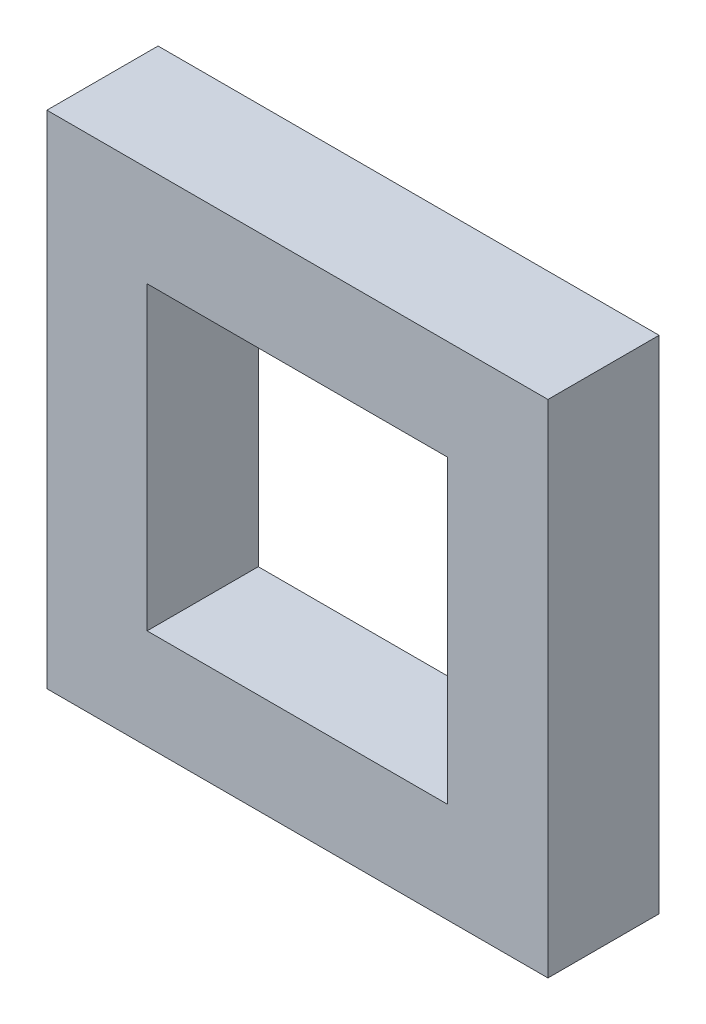
ISO-10303-21;
HEADER;
FILE_DESCRIPTION(('STEP AP214'),'2;1');
FILE_NAME('part.step','',(''),(''),'','','');
FILE_SCHEMA(('AUTOMOTIVE_DESIGN { 1 0 10303 214 1 1 1 1 }'));
ENDSEC;
DATA;
#1=APPLICATION_CONTEXT('core data for automotive mechanical design processes');
#2=APPLICATION_PROTOCOL_DEFINITION('international standard','automotive_design',2000,#1);
#3=PRODUCT_CONTEXT('',#1,'mechanical');
#4=PRODUCT('Part','Part','',(#3));
#5=PRODUCT_RELATED_PRODUCT_CATEGORY('part','',(#4));
#6=PRODUCT_DEFINITION_FORMATION('','',#4);
#7=PRODUCT_DEFINITION_CONTEXT('part definition',#1,'design');
#8=PRODUCT_DEFINITION('design','',#6,#7);
#9=PRODUCT_DEFINITION_SHAPE('','',#8);
#10=(LENGTH_UNIT() NAMED_UNIT(*) SI_UNIT(.MILLI.,.METRE.));
#11=(NAMED_UNIT(*) PLANE_ANGLE_UNIT() SI_UNIT($,.RADIAN.));
#12=(NAMED_UNIT(*) SI_UNIT($,.STERADIAN.) SOLID_ANGLE_UNIT());
#13=UNCERTAINTY_MEASURE_WITH_UNIT(LENGTH_MEASURE(1.E-05),#10,'distance_accuracy_value','');
#14=(GEOMETRIC_REPRESENTATION_CONTEXT(3) GLOBAL_UNCERTAINTY_ASSIGNED_CONTEXT((#13)) GLOBAL_UNIT_ASSIGNED_CONTEXT((#10,
#11,#12)) REPRESENTATION_CONTEXT('',''));
#15=CARTESIAN_POINT('',(0.,0.,0.));
#16=DIRECTION('',(0.,0.,1.));
#17=DIRECTION('',(1.,0.,0.));
#18=AXIS2_PLACEMENT_3D('',#15,#16,#17);
#19=CARTESIAN_POINT('',(0.297515400946636,11.6066255974756,0.15));
#20=DIRECTION('',(0.,-1.,0.));
#21=DIRECTION('',(0.,0.,-1.));
#22=AXIS2_PLACEMENT_3D('',#19,#20,#21);
#23=PLANE('',#22);
#24=DIRECTION('',(-1.,0.,0.));
#25=VECTOR('',#24,1.);
#26=CARTESIAN_POINT('',(0.793374402524363,11.6066255974756,0.15));
#27=LINE('',#26,#25);
#28=CARTESIAN_POINT('',(0.793374402524363,11.6066255974756,0.15));
#29=VERTEX_POINT('',#28);
#30=CARTESIAN_POINT('',(0.297515400946636,11.6066255974756,0.15));
#31=VERTEX_POINT('',#30);
#32=EDGE_CURVE('E84',#29,#31,#27,.T.);
#33=ORIENTED_EDGE('',*,*,#32,.F.);
#34=DIRECTION('',(0.,0.,1.));
#35=VECTOR('',#34,1.);
#36=CARTESIAN_POINT('',(0.793374402524363,11.6066255974756,0.15));
#37=LINE('',#36,#35);
#38=CARTESIAN_POINT('',(0.793374402524363,11.6066255974756,0.26));
#39=VERTEX_POINT('',#38);
#40=EDGE_CURVE('E161',#29,#39,#37,.T.);
#41=ORIENTED_EDGE('',*,*,#40,.T.);
#42=DIRECTION('',(1.,0.,0.));
#43=VECTOR('',#42,1.);
#44=CARTESIAN_POINT('',(0.793374402524363,11.6066255974756,0.26));
#45=LINE('',#44,#43);
#46=CARTESIAN_POINT('',(0.297515400946636,11.6066255974756,0.26));
#47=VERTEX_POINT('',#46);
#48=EDGE_CURVE('E130',#47,#39,#45,.T.);
#49=ORIENTED_EDGE('',*,*,#48,.F.);
#50=DIRECTION('',(0.,0.,1.));
#51=VECTOR('',#50,1.);
#52=CARTESIAN_POINT('',(0.297515400946636,11.6066255974756,0.15));
#53=LINE('',#52,#51);
#54=EDGE_CURVE('E139',#31,#47,#53,.T.);
#55=ORIENTED_EDGE('',*,*,#54,.F.);
#56=EDGE_LOOP('',(#33,#41,#49,#55));
#57=FACE_BOUND('',#56,.T.);
#58=ADVANCED_FACE('F16',(#57),#23,.T.);
#59=CARTESIAN_POINT('',(0.396687201262181,12.0033127987378,0.15));
#60=DIRECTION('',(0.,-1.,0.));
#61=DIRECTION('',(0.,0.,-1.));
#62=AXIS2_PLACEMENT_3D('',#59,#60,#61);
#63=PLANE('',#62);
#64=DIRECTION('',(1.,0.,0.));
#65=VECTOR('',#64,1.);
#66=CARTESIAN_POINT('',(0.396687201262181,12.0033127987378,0.15));
#67=LINE('',#66,#65);
#68=CARTESIAN_POINT('',(0.396687201262181,12.0033127987378,0.15));
#69=VERTEX_POINT('',#68);
#70=CARTESIAN_POINT('',(0.694202602208818,12.0033127987378,0.15));
#71=VERTEX_POINT('',#70);
#72=EDGE_CURVE('E105',#69,#71,#67,.T.);
#73=ORIENTED_EDGE('',*,*,#72,.T.);
#74=DIRECTION('',(0.,0.,1.));
#75=VECTOR('',#74,1.);
#76=CARTESIAN_POINT('',(0.694202602208818,12.0033127987378,0.15));
#77=LINE('',#76,#75);
#78=CARTESIAN_POINT('',(0.694202602208818,12.0033127987378,0.26));
#79=VERTEX_POINT('',#78);
#80=EDGE_CURVE('E174',#71,#79,#77,.T.);
#81=ORIENTED_EDGE('',*,*,#80,.T.);
#82=DIRECTION('',(1.,0.,0.));
#83=VECTOR('',#82,1.);
#84=CARTESIAN_POINT('',(0.396687201262181,12.0033127987378,0.26));
#85=LINE('',#84,#83);
#86=CARTESIAN_POINT('',(0.396687201262181,12.0033127987378,0.26));
#87=VERTEX_POINT('',#86);
#88=EDGE_CURVE('E152',#87,#79,#85,.T.);
#89=ORIENTED_EDGE('',*,*,#88,.F.);
#90=DIRECTION('',(0.,0.,1.));
#91=VECTOR('',#90,1.);
#92=CARTESIAN_POINT('',(0.396687201262181,12.0033127987378,0.15));
#93=LINE('',#92,#91);
#94=EDGE_CURVE('E11',#69,#87,#93,.T.);
#95=ORIENTED_EDGE('',*,*,#94,.F.);
#96=EDGE_LOOP('',(#73,#81,#89,#95));
#97=FACE_BOUND('',#96,.T.);
#98=ADVANCED_FACE('F276',(#97),#63,.T.);
#99=CARTESIAN_POINT('',(0.793374402524363,12.1024845990534,0.15));
#100=DIRECTION('',(0.,1.,0.));
#101=DIRECTION('',(1.,0.,0.));
#102=AXIS2_PLACEMENT_3D('',#99,#100,#101);
#103=PLANE('',#102);
#104=DIRECTION('',(1.,0.,0.));
#105=VECTOR('',#104,1.);
#106=CARTESIAN_POINT('',(0.297515400946636,12.1024845990534,0.15));
#107=LINE('',#106,#105);
#108=CARTESIAN_POINT('',(0.297515400946636,12.1024845990534,0.15));
#109=VERTEX_POINT('',#108);
#110=CARTESIAN_POINT('',(0.793374402524363,12.1024845990534,0.15));
#111=VERTEX_POINT('',#110);
#112=EDGE_CURVE('E97',#109,#111,#107,.T.);
#113=ORIENTED_EDGE('',*,*,#112,.F.);
#114=DIRECTION('',(0.,0.,1.));
#115=VECTOR('',#114,1.);
#116=CARTESIAN_POINT('',(0.297515400946636,12.1024845990534,0.15));
#117=LINE('',#116,#115);
#118=CARTESIAN_POINT('',(0.297515400946636,12.1024845990534,0.26));
#119=VERTEX_POINT('',#118);
#120=EDGE_CURVE('E131',#109,#119,#117,.T.);
#121=ORIENTED_EDGE('',*,*,#120,.T.);
#122=DIRECTION('',(-1.,0.,0.));
#123=VECTOR('',#122,1.);
#124=CARTESIAN_POINT('',(0.297515400946636,12.1024845990534,0.26));
#125=LINE('',#124,#123);
#126=CARTESIAN_POINT('',(0.793374402524363,12.1024845990534,0.26));
#127=VERTEX_POINT('',#126);
#128=EDGE_CURVE('E122',#127,#119,#125,.T.);
#129=ORIENTED_EDGE('',*,*,#128,.F.);
#130=DIRECTION('',(0.,0.,1.));
#131=VECTOR('',#130,1.);
#132=CARTESIAN_POINT('',(0.793374402524363,12.1024845990534,0.15));
#133=LINE('',#132,#131);
#134=EDGE_CURVE('E158',#111,#127,#133,.T.);
#135=ORIENTED_EDGE('',*,*,#134,.F.);
#136=EDGE_LOOP('',(#113,#121,#129,#135));
#137=FACE_BOUND('',#136,.T.);
#138=ADVANCED_FACE('F133',(#137),#103,.T.);
#139=CARTESIAN_POINT('',(0.396687201262181,11.7057973977912,0.15));
#140=DIRECTION('',(1.,0.,0.));
#141=DIRECTION('',(0.,1.,0.));
#142=AXIS2_PLACEMENT_3D('',#139,#140,#141);
#143=PLANE('',#142);
#144=DIRECTION('',(0.,1.,0.));
#145=VECTOR('',#144,1.);
#146=CARTESIAN_POINT('',(0.396687201262181,11.7057973977912,0.15));
#147=LINE('',#146,#145);
#148=CARTESIAN_POINT('',(0.396687201262181,11.7057973977912,0.15));
#149=VERTEX_POINT('',#148);
#150=EDGE_CURVE('E20',#149,#69,#147,.T.);
#151=ORIENTED_EDGE('',*,*,#150,.T.);
#152=ORIENTED_EDGE('',*,*,#94,.T.);
#153=DIRECTION('',(0.,1.,0.));
#154=VECTOR('',#153,1.);
#155=CARTESIAN_POINT('',(0.396687201262181,11.7057973977912,0.26));
#156=LINE('',#155,#154);
#157=CARTESIAN_POINT('',(0.396687201262181,11.7057973977912,0.26));
#158=VERTEX_POINT('',#157);
#159=EDGE_CURVE('E168',#158,#87,#156,.T.);
#160=ORIENTED_EDGE('',*,*,#159,.F.);
#161=DIRECTION('',(0.,0.,1.));
#162=VECTOR('',#161,1.);
#163=CARTESIAN_POINT('',(0.396687201262181,11.7057973977912,0.15));
#164=LINE('',#163,#162);
#165=EDGE_CURVE('E26',#149,#158,#164,.T.);
#166=ORIENTED_EDGE('',*,*,#165,.F.);
#167=EDGE_LOOP('',(#151,#152,#160,#166));
#168=FACE_BOUND('',#167,.T.);
#169=ADVANCED_FACE('F297',(#168),#143,.T.);
#170=CARTESIAN_POINT('',(0.694202602208818,11.7057973977912,0.15));
#171=DIRECTION('',(0.,1.,0.));
#172=DIRECTION('',(1.,0.,0.));
#173=AXIS2_PLACEMENT_3D('',#170,#171,#172);
#174=PLANE('',#173);
#175=DIRECTION('',(-1.,0.,0.));
#176=VECTOR('',#175,1.);
#177=CARTESIAN_POINT('',(0.694202602208818,11.7057973977912,0.15));
#178=LINE('',#177,#176);
#179=CARTESIAN_POINT('',(0.694202602208818,11.7057973977912,0.15));
#180=VERTEX_POINT('',#179);
#181=EDGE_CURVE('E164',#180,#149,#178,.T.);
#182=ORIENTED_EDGE('',*,*,#181,.T.);
#183=ORIENTED_EDGE('',*,*,#165,.T.);
#184=DIRECTION('',(-1.,0.,0.));
#185=VECTOR('',#184,1.);
#186=CARTESIAN_POINT('',(0.694202602208818,11.7057973977912,0.26));
#187=LINE('',#186,#185);
#188=CARTESIAN_POINT('',(0.694202602208818,11.7057973977912,0.26));
#189=VERTEX_POINT('',#188);
#190=EDGE_CURVE('E172',#189,#158,#187,.T.);
#191=ORIENTED_EDGE('',*,*,#190,.F.);
#192=DIRECTION('',(0.,0.,1.));
#193=VECTOR('',#192,1.);
#194=CARTESIAN_POINT('',(0.694202602208818,11.7057973977912,0.15));
#195=LINE('',#194,#193);
#196=EDGE_CURVE('E193',#180,#189,#195,.T.);
#197=ORIENTED_EDGE('',*,*,#196,.F.);
#198=EDGE_LOOP('',(#182,#183,#191,#197));
#199=FACE_BOUND('',#198,.T.);
#200=ADVANCED_FACE('F302',(#199),#174,.T.);
#201=CARTESIAN_POINT('',(0.5454449017355,11.8545550982645,0.15));
#202=DIRECTION('',(0.,0.,1.));
#203=DIRECTION('',(1.,0.,0.));
#204=AXIS2_PLACEMENT_3D('',#201,#202,#203);
#205=PLANE('',#204);
#206=ORIENTED_EDGE('',*,*,#181,.F.);
#207=DIRECTION('',(0.,-1.,0.));
#208=VECTOR('',#207,1.);
#209=CARTESIAN_POINT('',(0.694202602208818,12.0033127987378,0.15));
#210=LINE('',#209,#208);
#211=EDGE_CURVE('E167',#71,#180,#210,.T.);
#212=ORIENTED_EDGE('',*,*,#211,.F.);
#213=ORIENTED_EDGE('',*,*,#72,.F.);
#214=ORIENTED_EDGE('',*,*,#150,.F.);
#215=EDGE_LOOP('',(#206,#212,#213,#214));
#216=FACE_BOUND('',#215,.T.);
#217=ORIENTED_EDGE('',*,*,#112,.T.);
#218=DIRECTION('',(0.,-1.,0.));
#219=VECTOR('',#218,1.);
#220=CARTESIAN_POINT('',(0.793374402524363,12.1024845990534,0.15));
#221=LINE('',#220,#219);
#222=EDGE_CURVE('E156',#111,#29,#221,.T.);
#223=ORIENTED_EDGE('',*,*,#222,.T.);
#224=ORIENTED_EDGE('',*,*,#32,.T.);
#225=DIRECTION('',(0.,1.,0.));
#226=VECTOR('',#225,1.);
#227=CARTESIAN_POINT('',(0.297515400946636,11.6066255974756,0.15));
#228=LINE('',#227,#226);
#229=EDGE_CURVE('E148',#31,#109,#228,.T.);
#230=ORIENTED_EDGE('',*,*,#229,.T.);
#231=EDGE_LOOP('',(#217,#223,#224,#230));
#232=FACE_BOUND('',#231,.T.);
#233=ADVANCED_FACE('F180',(#216,#232),#205,.F.);
#234=CARTESIAN_POINT('',(0.694202602208818,12.0033127987378,0.15));
#235=DIRECTION('',(-1.,0.,0.));
#236=DIRECTION('',(0.,0.,1.));
#237=AXIS2_PLACEMENT_3D('',#234,#235,#236);
#238=PLANE('',#237);
#239=ORIENTED_EDGE('',*,*,#211,.T.);
#240=ORIENTED_EDGE('',*,*,#196,.T.);
#241=DIRECTION('',(0.,-1.,0.));
#242=VECTOR('',#241,1.);
#243=CARTESIAN_POINT('',(0.694202602208818,12.0033127987378,0.26));
#244=LINE('',#243,#242);
#245=EDGE_CURVE('E154',#79,#189,#244,.T.);
#246=ORIENTED_EDGE('',*,*,#245,.F.);
#247=ORIENTED_EDGE('',*,*,#80,.F.);
#248=EDGE_LOOP('',(#239,#240,#246,#247));
#249=FACE_BOUND('',#248,.T.);
#250=ADVANCED_FACE('F309',(#249),#238,.T.);
#251=CARTESIAN_POINT('',(0.793374402524363,11.6066255974756,0.15));
#252=DIRECTION('',(1.,0.,0.));
#253=DIRECTION('',(0.,-1.,0.));
#254=AXIS2_PLACEMENT_3D('',#251,#252,#253);
#255=PLANE('',#254);
#256=ORIENTED_EDGE('',*,*,#222,.F.);
#257=ORIENTED_EDGE('',*,*,#134,.T.);
#258=DIRECTION('',(0.,1.,0.));
#259=VECTOR('',#258,1.);
#260=CARTESIAN_POINT('',(0.793374402524363,12.1024845990534,0.26));
#261=LINE('',#260,#259);
#262=EDGE_CURVE('E128',#39,#127,#261,.T.);
#263=ORIENTED_EDGE('',*,*,#262,.F.);
#264=ORIENTED_EDGE('',*,*,#40,.F.);
#265=EDGE_LOOP('',(#256,#257,#263,#264));
#266=FACE_BOUND('',#265,.T.);
#267=ADVANCED_FACE('F182',(#266),#255,.T.);
#268=CARTESIAN_POINT('',(0.5454449017355,11.8545550982645,0.26));
#269=DIRECTION('',(0.,0.,1.));
#270=DIRECTION('',(1.,0.,0.));
#271=AXIS2_PLACEMENT_3D('',#268,#269,#270);
#272=PLANE('',#271);
#273=ORIENTED_EDGE('',*,*,#190,.T.);
#274=ORIENTED_EDGE('',*,*,#159,.T.);
#275=ORIENTED_EDGE('',*,*,#88,.T.);
#276=ORIENTED_EDGE('',*,*,#245,.T.);
#277=EDGE_LOOP('',(#273,#274,#275,#276));
#278=FACE_BOUND('',#277,.T.);
#279=ORIENTED_EDGE('',*,*,#128,.T.);
#280=DIRECTION('',(0.,-1.,0.));
#281=VECTOR('',#280,1.);
#282=CARTESIAN_POINT('',(0.297515400946636,11.6066255974756,0.26));
#283=LINE('',#282,#281);
#284=EDGE_CURVE('E125',#119,#47,#283,.T.);
#285=ORIENTED_EDGE('',*,*,#284,.T.);
#286=ORIENTED_EDGE('',*,*,#48,.T.);
#287=ORIENTED_EDGE('',*,*,#262,.T.);
#288=EDGE_LOOP('',(#279,#285,#286,#287));
#289=FACE_BOUND('',#288,.T.);
#290=ADVANCED_FACE('F18',(#278,#289),#272,.T.);
#291=CARTESIAN_POINT('',(0.297515400946636,12.1024845990534,0.15));
#292=DIRECTION('',(-1.,0.,0.));
#293=DIRECTION('',(0.,0.,1.));
#294=AXIS2_PLACEMENT_3D('',#291,#292,#293);
#295=PLANE('',#294);
#296=ORIENTED_EDGE('',*,*,#229,.F.);
#297=ORIENTED_EDGE('',*,*,#54,.T.);
#298=ORIENTED_EDGE('',*,*,#284,.F.);
#299=ORIENTED_EDGE('',*,*,#120,.F.);
#300=EDGE_LOOP('',(#296,#297,#298,#299));
#301=FACE_BOUND('',#300,.T.);
#302=ADVANCED_FACE('F138',(#301),#295,.T.);
#303=CLOSED_SHELL('',(#58,#98,#138,#169,#200,#233,#250,#267,#290,#302));
#304=MANIFOLD_SOLID_BREP('B1',#303);
#305=ADVANCED_BREP_SHAPE_REPRESENTATION('',(#18,#304),#14);
#306=SHAPE_DEFINITION_REPRESENTATION(#9,#305);
ENDSEC;
END-ISO-10303-21;
